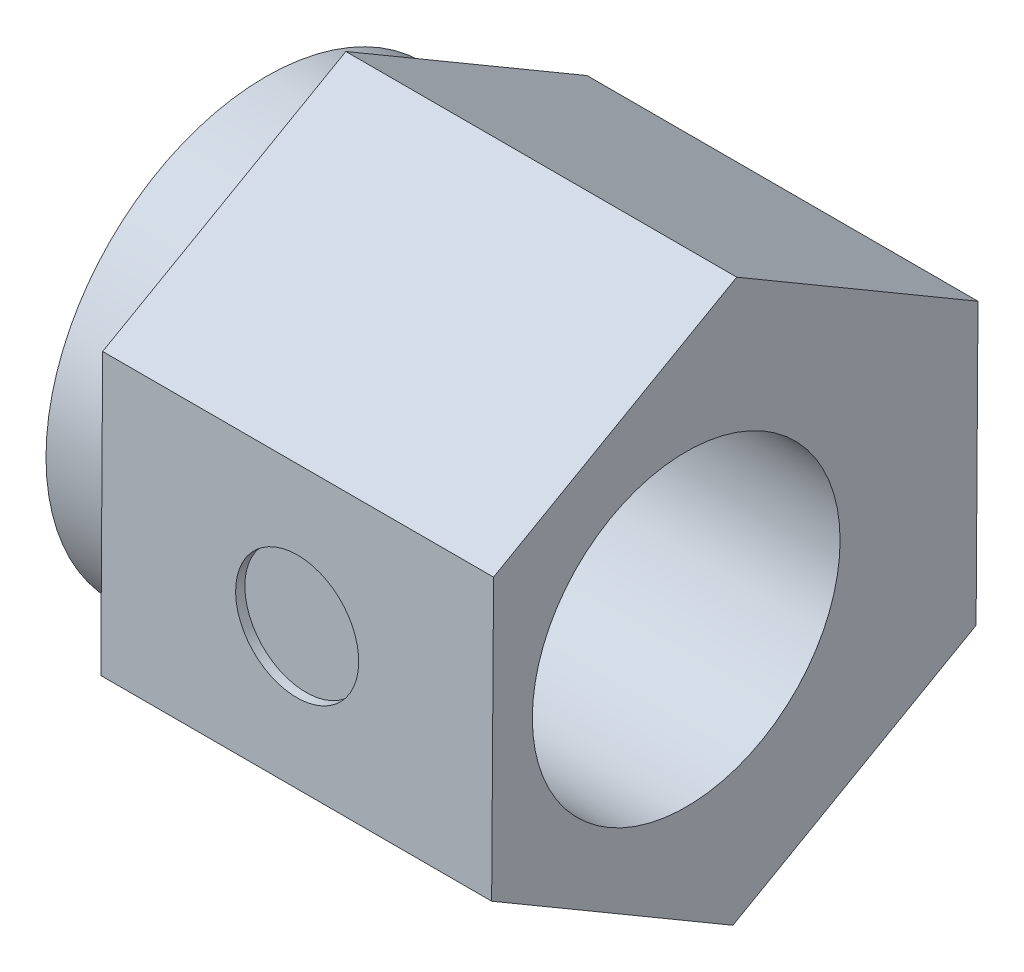
ISO-10303-21;
HEADER;
FILE_DESCRIPTION(('STEP AP214'),'2;1');
FILE_NAME('part.step','',(''),(''),'','','');
FILE_SCHEMA(('AUTOMOTIVE_DESIGN { 1 0 10303 214 1 1 1 1 }'));
ENDSEC;
DATA;
#1=APPLICATION_CONTEXT('core data for automotive mechanical design processes');
#2=APPLICATION_PROTOCOL_DEFINITION('international standard','automotive_design',2000,#1);
#3=PRODUCT_CONTEXT('',#1,'mechanical');
#4=PRODUCT('Part','Part','',(#3));
#5=PRODUCT_RELATED_PRODUCT_CATEGORY('part','',(#4));
#6=PRODUCT_DEFINITION_FORMATION('','',#4);
#7=PRODUCT_DEFINITION_CONTEXT('part definition',#1,'design');
#8=PRODUCT_DEFINITION('design','',#6,#7);
#9=PRODUCT_DEFINITION_SHAPE('','',#8);
#10=(LENGTH_UNIT() NAMED_UNIT(*) SI_UNIT(.MILLI.,.METRE.));
#11=(NAMED_UNIT(*) PLANE_ANGLE_UNIT() SI_UNIT($,.RADIAN.));
#12=(NAMED_UNIT(*) SI_UNIT($,.STERADIAN.) SOLID_ANGLE_UNIT());
#13=UNCERTAINTY_MEASURE_WITH_UNIT(LENGTH_MEASURE(1.E-05),#10,'distance_accuracy_value','');
#14=(GEOMETRIC_REPRESENTATION_CONTEXT(3) GLOBAL_UNCERTAINTY_ASSIGNED_CONTEXT((#13)) GLOBAL_UNIT_ASSIGNED_CONTEXT((#10,
#11,#12)) REPRESENTATION_CONTEXT('',''));
#15=CARTESIAN_POINT('',(0.,0.,0.));
#16=DIRECTION('',(0.,0.,1.));
#17=DIRECTION('',(1.,0.,0.));
#18=AXIS2_PLACEMENT_3D('',#15,#16,#17);
#19=CARTESIAN_POINT('',(6.35,2.29861751972744,3.91943756568916));
#20=DIRECTION('',(0.,-0.00680988299330344,-0.999976812477978));
#21=DIRECTION('',(0.,0.999976812477978,-0.00680988299330344));
#22=AXIS2_PLACEMENT_3D('',#19,#20,#21);
#23=PLANE('',#22);
#24=DIRECTION('',(0.,-0.999976812477978,0.00680988299330344));
#25=VECTOR('',#24,1.);
#26=CARTESIAN_POINT('',(0.,2.29861751972744,3.91943756568916));
#27=LINE('',#26,#25);
#28=CARTESIAN_POINT('',(0.,2.29861751972744,3.91943756568916));
#29=VERTEX_POINT('',#28);
#30=CARTESIAN_POINT('',(0.,-2.24502374057014,3.95037994851252));
#31=VERTEX_POINT('',#30);
#32=EDGE_CURVE('E73',#29,#31,#27,.T.);
#33=ORIENTED_EDGE('',*,*,#32,.T.);
#34=DIRECTION('',(-1.,0.,0.));
#35=VECTOR('',#34,1.);
#36=CARTESIAN_POINT('',(6.35,-2.24502374057014,3.95037994851252));
#37=LINE('',#36,#35);
#38=CARTESIAN_POINT('',(6.35,-2.24502374057014,3.95037994851252));
#39=VERTEX_POINT('',#38);
#40=EDGE_CURVE('E111',#39,#31,#37,.T.);
#41=ORIENTED_EDGE('',*,*,#40,.F.);
#42=DIRECTION('',(0.,-0.999976812477978,0.00680988299330344));
#43=VECTOR('',#42,1.);
#44=CARTESIAN_POINT('',(6.35,2.29861751972744,3.91943756568916));
#45=LINE('',#44,#43);
#46=CARTESIAN_POINT('',(6.35,2.29861751972744,3.91943756568916));
#47=VERTEX_POINT('',#46);
#48=EDGE_CURVE('E99',#47,#39,#45,.T.);
#49=ORIENTED_EDGE('',*,*,#48,.F.);
#50=DIRECTION('',(-1.,0.,0.));
#51=VECTOR('',#50,1.);
#52=CARTESIAN_POINT('',(6.35,2.29861751972744,3.91943756568916));
#53=LINE('',#52,#51);
#54=EDGE_CURVE('E106',#47,#29,#53,.T.);
#55=ORIENTED_EDGE('',*,*,#54,.T.);
#56=EDGE_LOOP('',(#33,#41,#49,#55));
#57=FACE_BOUND('',#56,.T.);
#58=CARTESIAN_POINT('',(3.175,0.026796889578649,3.93490875710084));
#59=DIRECTION('',(0.,-0.00680988299330344,-0.999976812477978));
#60=DIRECTION('',(0.,0.999976812477978,-0.00680988299330344));
#61=AXIS2_PLACEMENT_3D('',#58,#59,#60);
#62=CIRCLE('',#61,0.999999999999998);
#63=CARTESIAN_POINT('',(3.175,1.02677370205663,3.92809887410754));
#64=VERTEX_POINT('',#63);
#65=EDGE_CURVE('E159',#64,#64,#62,.T.);
#66=ORIENTED_EDGE('',*,*,#65,.T.);
#67=EDGE_LOOP('',(#66));
#68=FACE_BOUND('',#67,.T.);
#69=ADVANCED_FACE('F33',(#57,#68),#23,.F.);
#70=CARTESIAN_POINT('',(0.,0.,0.));
#71=DIRECTION('',(1.,0.,0.));
#72=DIRECTION('',(0.,0.,-1.));
#73=AXIS2_PLACEMENT_3D('',#70,#71,#72);
#74=PLANE('',#73);
#75=DIRECTION('',(0.,0.494090874569989,-0.869410264297968));
#76=VECTOR('',#75,1.);
#77=CARTESIAN_POINT('',(0.,-4.54364126029758,0.0309423828233433));
#78=LINE('',#77,#76);
#79=CARTESIAN_POINT('',(0.,-4.54364126029758,0.0309423828233433));
#80=VERTEX_POINT('',#79);
#81=CARTESIAN_POINT('',(0.,-2.29861751972745,-3.91943756568916));
#82=VERTEX_POINT('',#81);
#83=EDGE_CURVE('E119',#80,#82,#78,.T.);
#84=ORIENTED_EDGE('',*,*,#83,.F.);
#85=DIRECTION('',(0.,-0.50588593790799,-0.862600381304665));
#86=VECTOR('',#85,1.);
#87=CARTESIAN_POINT('',(0.,-2.24502374057014,3.95037994851252));
#88=LINE('',#87,#86);
#89=EDGE_CURVE('E79',#31,#80,#88,.T.);
#90=ORIENTED_EDGE('',*,*,#89,.F.);
#91=ORIENTED_EDGE('',*,*,#32,.F.);
#92=DIRECTION('',(0.,-0.494090874569989,0.869410264297968));
#93=VECTOR('',#92,1.);
#94=CARTESIAN_POINT('',(0.,4.54364126029758,-0.0309423828233572));
#95=LINE('',#94,#93);
#96=CARTESIAN_POINT('',(0.,4.54364126029758,-0.0309423828233572));
#97=VERTEX_POINT('',#96);
#98=EDGE_CURVE('E109',#97,#29,#95,.T.);
#99=ORIENTED_EDGE('',*,*,#98,.F.);
#100=DIRECTION('',(0.,0.505885937907989,0.862600381304665));
#101=VECTOR('',#100,1.);
#102=CARTESIAN_POINT('',(0.,2.24502374057014,-3.95037994851252));
#103=LINE('',#102,#101);
#104=CARTESIAN_POINT('',(0.,2.24502374057014,-3.95037994851252));
#105=VERTEX_POINT('',#104);
#106=EDGE_CURVE('E125',#105,#97,#103,.T.);
#107=ORIENTED_EDGE('',*,*,#106,.F.);
#108=DIRECTION('',(0.,0.999976812477978,-0.00680988299330266));
#109=VECTOR('',#108,1.);
#110=CARTESIAN_POINT('',(0.,-2.29861751972745,-3.91943756568916));
#111=LINE('',#110,#109);
#112=EDGE_CURVE('E122',#82,#105,#111,.T.);
#113=ORIENTED_EDGE('',*,*,#112,.F.);
#114=EDGE_LOOP('',(#84,#90,#91,#99,#107,#113));
#115=FACE_BOUND('',#114,.T.);
#116=CARTESIAN_POINT('',(0.,0.,0.));
#117=DIRECTION('',(1.,0.,0.));
#118=DIRECTION('',(0.,0.,-1.));
#119=AXIS2_PLACEMENT_3D('',#116,#117,#118);
#120=CIRCLE('',#119,3.57);
#121=CARTESIAN_POINT('',(0.,0.,-3.57));
#122=VERTEX_POINT('',#121);
#123=EDGE_CURVE('E11',#122,#122,#120,.F.);
#124=ORIENTED_EDGE('',*,*,#123,.F.);
#125=EDGE_LOOP('',(#124));
#126=FACE_BOUND('',#125,.T.);
#127=ADVANCED_FACE('F142',(#115,#126),#74,.F.);
#128=CARTESIAN_POINT('',(6.35,-4.54364126029758,0.0309423828233433));
#129=DIRECTION('',(0.,0.869410264297968,0.494090874569989));
#130=DIRECTION('',(0.,-0.494090874569989,0.869410264297969));
#131=AXIS2_PLACEMENT_3D('',#128,#129,#130);
#132=PLANE('',#131);
#133=ORIENTED_EDGE('',*,*,#83,.T.);
#134=DIRECTION('',(-1.,0.,0.));
#135=VECTOR('',#134,1.);
#136=CARTESIAN_POINT('',(6.35,-2.29861751972745,-3.91943756568916));
#137=LINE('',#136,#135);
#138=CARTESIAN_POINT('',(6.35,-2.29861751972745,-3.91943756568916));
#139=VERTEX_POINT('',#138);
#140=EDGE_CURVE('E42',#139,#82,#137,.T.);
#141=ORIENTED_EDGE('',*,*,#140,.F.);
#142=DIRECTION('',(0.,0.494090874569989,-0.869410264297968));
#143=VECTOR('',#142,1.);
#144=CARTESIAN_POINT('',(6.35,-4.54364126029758,0.0309423828233433));
#145=LINE('',#144,#143);
#146=CARTESIAN_POINT('',(6.35,-4.54364126029758,0.0309423828233433));
#147=VERTEX_POINT('',#146);
#148=EDGE_CURVE('E130',#147,#139,#145,.T.);
#149=ORIENTED_EDGE('',*,*,#148,.F.);
#150=DIRECTION('',(-1.,0.,0.));
#151=VECTOR('',#150,1.);
#152=CARTESIAN_POINT('',(6.35,-4.54364126029758,0.0309423828233433));
#153=LINE('',#152,#151);
#154=EDGE_CURVE('E115',#147,#80,#153,.T.);
#155=ORIENTED_EDGE('',*,*,#154,.T.);
#156=EDGE_LOOP('',(#133,#141,#149,#155));
#157=FACE_BOUND('',#156,.T.);
#158=ADVANCED_FACE('F35',(#157),#132,.F.);
#159=CARTESIAN_POINT('',(6.35,-2.29861751972745,-3.91943756568916));
#160=DIRECTION('',(0.,0.00680988299330266,0.999976812477978));
#161=DIRECTION('',(0.,-0.999976812477978,0.00680988299330266));
#162=AXIS2_PLACEMENT_3D('',#159,#160,#161);
#163=PLANE('',#162);
#164=ORIENTED_EDGE('',*,*,#112,.T.);
#165=DIRECTION('',(-1.,0.,0.));
#166=VECTOR('',#165,1.);
#167=CARTESIAN_POINT('',(6.35,2.24502374057014,-3.95037994851252));
#168=LINE('',#167,#166);
#169=CARTESIAN_POINT('',(6.35,2.24502374057014,-3.95037994851252));
#170=VERTEX_POINT('',#169);
#171=EDGE_CURVE('E134',#170,#105,#168,.T.);
#172=ORIENTED_EDGE('',*,*,#171,.F.);
#173=DIRECTION('',(0.,0.999976812477978,-0.00680988299330266));
#174=VECTOR('',#173,1.);
#175=CARTESIAN_POINT('',(6.35,-2.29861751972745,-3.91943756568916));
#176=LINE('',#175,#174);
#177=EDGE_CURVE('E88',#139,#170,#176,.T.);
#178=ORIENTED_EDGE('',*,*,#177,.F.);
#179=ORIENTED_EDGE('',*,*,#140,.T.);
#180=EDGE_LOOP('',(#164,#172,#178,#179));
#181=FACE_BOUND('',#180,.T.);
#182=ADVANCED_FACE('F137',(#181),#163,.F.);
#183=CARTESIAN_POINT('',(6.35,2.24502374057014,-3.95037994851252));
#184=DIRECTION('',(0.,-0.862600381304665,0.505885937907989));
#185=DIRECTION('',(0.,-0.505885937907989,-0.862600381304665));
#186=AXIS2_PLACEMENT_3D('',#183,#184,#185);
#187=PLANE('',#186);
#188=ORIENTED_EDGE('',*,*,#106,.T.);
#189=DIRECTION('',(-1.,0.,0.));
#190=VECTOR('',#189,1.);
#191=CARTESIAN_POINT('',(6.35,4.54364126029758,-0.0309423828233572));
#192=LINE('',#191,#190);
#193=CARTESIAN_POINT('',(6.35,4.54364126029758,-0.0309423828233572));
#194=VERTEX_POINT('',#193);
#195=EDGE_CURVE('E110',#194,#97,#192,.T.);
#196=ORIENTED_EDGE('',*,*,#195,.F.);
#197=DIRECTION('',(0.,0.505885937907989,0.862600381304665));
#198=VECTOR('',#197,1.);
#199=CARTESIAN_POINT('',(6.35,2.24502374057014,-3.95037994851252));
#200=LINE('',#199,#198);
#201=EDGE_CURVE('E101',#170,#194,#200,.T.);
#202=ORIENTED_EDGE('',*,*,#201,.F.);
#203=ORIENTED_EDGE('',*,*,#171,.T.);
#204=EDGE_LOOP('',(#188,#196,#202,#203));
#205=FACE_BOUND('',#204,.T.);
#206=ADVANCED_FACE('F146',(#205),#187,.F.);
#207=CARTESIAN_POINT('',(6.35,4.54364126029758,-0.0309423828233572));
#208=DIRECTION('',(0.,-0.869410264297968,-0.494090874569989));
#209=DIRECTION('',(0.,0.494090874569989,-0.869410264297969));
#210=AXIS2_PLACEMENT_3D('',#207,#208,#209);
#211=PLANE('',#210);
#212=ORIENTED_EDGE('',*,*,#98,.T.);
#213=ORIENTED_EDGE('',*,*,#54,.F.);
#214=DIRECTION('',(0.,-0.494090874569989,0.869410264297968));
#215=VECTOR('',#214,1.);
#216=CARTESIAN_POINT('',(6.35,4.54364126029758,-0.0309423828233572));
#217=LINE('',#216,#215);
#218=EDGE_CURVE('E95',#194,#47,#217,.T.);
#219=ORIENTED_EDGE('',*,*,#218,.F.);
#220=ORIENTED_EDGE('',*,*,#195,.T.);
#221=EDGE_LOOP('',(#212,#213,#219,#220));
#222=FACE_BOUND('',#221,.T.);
#223=ADVANCED_FACE('F107',(#222),#211,.F.);
#224=CARTESIAN_POINT('',(6.35,-2.24502374057014,3.95037994851252));
#225=DIRECTION('',(0.,0.862600381304665,-0.50588593790799));
#226=DIRECTION('',(0.,0.50588593790799,0.862600381304665));
#227=AXIS2_PLACEMENT_3D('',#224,#225,#226);
#228=PLANE('',#227);
#229=ORIENTED_EDGE('',*,*,#89,.T.);
#230=ORIENTED_EDGE('',*,*,#154,.F.);
#231=DIRECTION('',(0.,-0.50588593790799,-0.862600381304665));
#232=VECTOR('',#231,1.);
#233=CARTESIAN_POINT('',(6.35,-2.24502374057014,3.95037994851252));
#234=LINE('',#233,#232);
#235=EDGE_CURVE('E50',#39,#147,#234,.T.);
#236=ORIENTED_EDGE('',*,*,#235,.F.);
#237=ORIENTED_EDGE('',*,*,#40,.T.);
#238=EDGE_LOOP('',(#229,#230,#236,#237));
#239=FACE_BOUND('',#238,.T.);
#240=ADVANCED_FACE('F184',(#239),#228,.F.);
#241=CARTESIAN_POINT('',(6.35,0.,0.));
#242=DIRECTION('',(1.,0.,0.));
#243=DIRECTION('',(0.,0.,-1.));
#244=AXIS2_PLACEMENT_3D('',#241,#242,#243);
#245=PLANE('',#244);
#246=CARTESIAN_POINT('',(6.35,0.,0.79));
#247=DIRECTION('',(-1.,0.,0.));
#248=DIRECTION('',(0.,0.,1.));
#249=AXIS2_PLACEMENT_3D('',#246,#247,#248);
#250=CIRCLE('',#249,2.5);
#251=CARTESIAN_POINT('',(6.35,0.,3.29));
#252=VERTEX_POINT('',#251);
#253=EDGE_CURVE('E152',#252,#252,#250,.T.);
#254=ORIENTED_EDGE('',*,*,#253,.T.);
#255=EDGE_LOOP('',(#254));
#256=FACE_BOUND('',#255,.T.);
#257=ORIENTED_EDGE('',*,*,#148,.T.);
#258=ORIENTED_EDGE('',*,*,#177,.T.);
#259=ORIENTED_EDGE('',*,*,#201,.T.);
#260=ORIENTED_EDGE('',*,*,#218,.T.);
#261=ORIENTED_EDGE('',*,*,#48,.T.);
#262=ORIENTED_EDGE('',*,*,#235,.T.);
#263=EDGE_LOOP('',(#257,#258,#259,#260,#261,#262));
#264=FACE_BOUND('',#263,.T.);
#265=ADVANCED_FACE('F97',(#256,#264),#245,.T.);
#266=CARTESIAN_POINT('',(-1.27,0.,0.));
#267=DIRECTION('',(1.,0.,0.));
#268=DIRECTION('',(0.,0.,-1.));
#269=AXIS2_PLACEMENT_3D('',#266,#267,#268);
#270=CYLINDRICAL_SURFACE('',#269,3.57);
#271=CARTESIAN_POINT('',(-1.27,0.,0.));
#272=DIRECTION('',(-1.,0.,0.));
#273=DIRECTION('',(0.,0.,1.));
#274=AXIS2_PLACEMENT_3D('',#271,#272,#273);
#275=CIRCLE('',#274,3.57);
#276=CARTESIAN_POINT('',(-1.27,0.,3.57));
#277=VERTEX_POINT('',#276);
#278=EDGE_CURVE('E123',#277,#277,#275,.T.);
#279=ORIENTED_EDGE('',*,*,#278,.F.);
#280=EDGE_LOOP('',(#279));
#281=FACE_BOUND('',#280,.T.);
#282=ORIENTED_EDGE('',*,*,#123,.T.);
#283=EDGE_LOOP('',(#282));
#284=FACE_BOUND('',#283,.T.);
#285=ADVANCED_FACE('F210',(#281,#284),#270,.T.);
#286=CARTESIAN_POINT('',(-1.27,0.,0.));
#287=DIRECTION('',(-1.,0.,0.));
#288=DIRECTION('',(0.,0.,1.));
#289=AXIS2_PLACEMENT_3D('',#286,#287,#288);
#290=PLANE('',#289);
#291=CARTESIAN_POINT('',(-1.27,0.,0.79));
#292=DIRECTION('',(-1.,0.,0.));
#293=DIRECTION('',(0.,0.,1.));
#294=AXIS2_PLACEMENT_3D('',#291,#292,#293);
#295=CIRCLE('',#294,2.5);
#296=CARTESIAN_POINT('',(-1.27,0.,3.29));
#297=VERTEX_POINT('',#296);
#298=EDGE_CURVE('E153',#297,#297,#295,.T.);
#299=ORIENTED_EDGE('',*,*,#298,.F.);
#300=EDGE_LOOP('',(#299));
#301=FACE_BOUND('',#300,.T.);
#302=ORIENTED_EDGE('',*,*,#278,.T.);
#303=EDGE_LOOP('',(#302));
#304=FACE_BOUND('',#303,.T.);
#305=ADVANCED_FACE('F214',(#301,#304),#290,.T.);
#306=CARTESIAN_POINT('',(6.35,0.,0.79));
#307=DIRECTION('',(-1.,0.,0.));
#308=DIRECTION('',(0.,0.,1.));
#309=AXIS2_PLACEMENT_3D('',#306,#307,#308);
#310=CYLINDRICAL_SURFACE('',#309,2.5);
#311=ORIENTED_EDGE('',*,*,#253,.F.);
#312=EDGE_LOOP('',(#311));
#313=FACE_BOUND('',#312,.T.);
#314=ORIENTED_EDGE('',*,*,#298,.T.);
#315=EDGE_LOOP('',(#314));
#316=FACE_BOUND('',#315,.T.);
#317=ADVANCED_FACE('F174',(#313,#316),#310,.F.);
#318=CARTESIAN_POINT('',(3.175,0.0257754071296535,3.78491223522914));
#319=DIRECTION('',(0.,0.00680988299330344,0.999976812477978));
#320=DIRECTION('',(0.,-0.999976812477978,0.00680988299330344));
#321=AXIS2_PLACEMENT_3D('',#318,#319,#320);
#322=CYLINDRICAL_SURFACE('',#321,0.999999999999998);
#323=CARTESIAN_POINT('',(3.175,0.0257754071296535,3.78491223522914));
#324=DIRECTION('',(0.,-0.00680988299330344,-0.999976812477978));
#325=DIRECTION('',(0.,0.999976812477978,-0.00680988299330344));
#326=AXIS2_PLACEMENT_3D('',#323,#324,#325);
#327=CIRCLE('',#326,0.999999999999998);
#328=CARTESIAN_POINT('',(3.175,1.02575221960763,3.77810235223584));
#329=VERTEX_POINT('',#328);
#330=EDGE_CURVE('E156',#329,#329,#327,.T.);
#331=ORIENTED_EDGE('',*,*,#330,.T.);
#332=EDGE_LOOP('',(#331));
#333=FACE_BOUND('',#332,.T.);
#334=ORIENTED_EDGE('',*,*,#65,.F.);
#335=EDGE_LOOP('',(#334));
#336=FACE_BOUND('',#335,.T.);
#337=ADVANCED_FACE('F165',(#333,#336),#322,.F.);
#338=CARTESIAN_POINT('',(3.175,0.0257754071296535,3.78491223522914));
#339=DIRECTION('',(0.,-0.00680988299330344,-0.999976812477978));
#340=DIRECTION('',(0.,0.999976812477978,-0.00680988299330344));
#341=AXIS2_PLACEMENT_3D('',#338,#339,#340);
#342=PLANE('',#341);
#343=ORIENTED_EDGE('',*,*,#330,.F.);
#344=EDGE_LOOP('',(#343));
#345=FACE_BOUND('',#344,.T.);
#346=ADVANCED_FACE('F168',(#345),#342,.F.);
#347=CLOSED_SHELL('',(#69,#127,#158,#182,#206,#223,#240,#265,#285,#305,#317,#337,#346));
#348=MANIFOLD_SOLID_BREP('B2',#347);
#349=ADVANCED_BREP_SHAPE_REPRESENTATION('',(#18,#348),#14);
#350=SHAPE_DEFINITION_REPRESENTATION(#9,#349);
ENDSEC;
END-ISO-10303-21;
